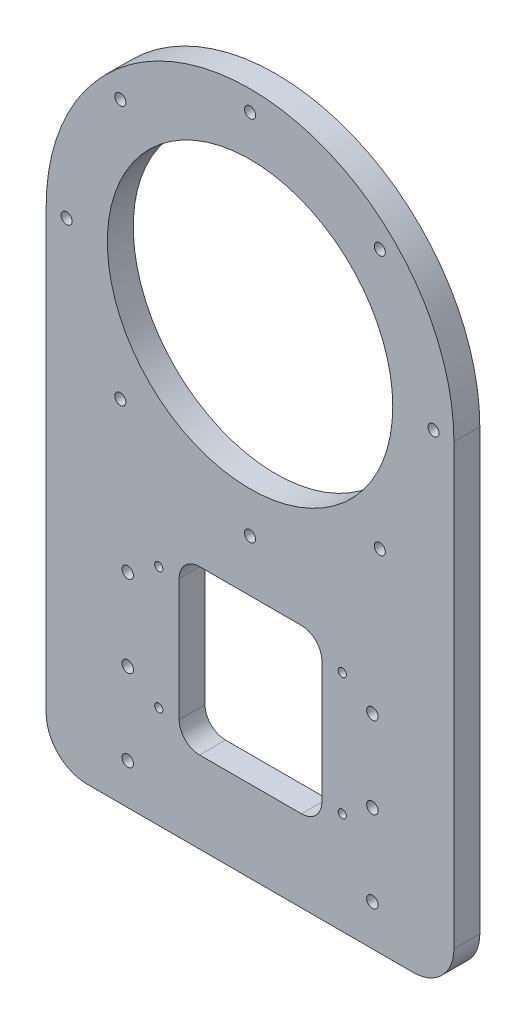
ISO-10303-21;
HEADER;
FILE_DESCRIPTION(('STEP AP214'),'2;1');
FILE_NAME('part.step','',(''),(''),'','','');
FILE_SCHEMA(('AUTOMOTIVE_DESIGN { 1 0 10303 214 1 1 1 1 }'));
ENDSEC;
DATA;
#1=APPLICATION_CONTEXT('core data for automotive mechanical design processes');
#2=APPLICATION_PROTOCOL_DEFINITION('international standard','automotive_design',2000,#1);
#3=PRODUCT_CONTEXT('',#1,'mechanical');
#4=PRODUCT('Part','Part','',(#3));
#5=PRODUCT_RELATED_PRODUCT_CATEGORY('part','',(#4));
#6=PRODUCT_DEFINITION_FORMATION('','',#4);
#7=PRODUCT_DEFINITION_CONTEXT('part definition',#1,'design');
#8=PRODUCT_DEFINITION('design','',#6,#7);
#9=PRODUCT_DEFINITION_SHAPE('','',#8);
#10=(LENGTH_UNIT() NAMED_UNIT(*) SI_UNIT(.MILLI.,.METRE.));
#11=(NAMED_UNIT(*) PLANE_ANGLE_UNIT() SI_UNIT($,.RADIAN.));
#12=(NAMED_UNIT(*) SI_UNIT($,.STERADIAN.) SOLID_ANGLE_UNIT());
#13=UNCERTAINTY_MEASURE_WITH_UNIT(LENGTH_MEASURE(1.E-05),#10,'distance_accuracy_value','');
#14=(GEOMETRIC_REPRESENTATION_CONTEXT(3) GLOBAL_UNCERTAINTY_ASSIGNED_CONTEXT((#13)) GLOBAL_UNIT_ASSIGNED_CONTEXT((#10,
#11,#12)) REPRESENTATION_CONTEXT('',''));
#15=CARTESIAN_POINT('',(0.,0.,0.));
#16=DIRECTION('',(0.,0.,1.));
#17=DIRECTION('',(1.,0.,0.));
#18=AXIS2_PLACEMENT_3D('',#15,#16,#17);
#19=CARTESIAN_POINT('',(0.,0.,6.35));
#20=DIRECTION('',(0.,0.,1.));
#21=DIRECTION('',(1.,0.,0.));
#22=AXIS2_PLACEMENT_3D('',#19,#20,#21);
#23=PLANE('',#22);
#24=CARTESIAN_POINT('',(22.6100045908899,-62.7000000000005,6.35));
#25=DIRECTION('',(0.,0.,-1.));
#26=DIRECTION('',(-1.,0.,0.));
#27=AXIS2_PLACEMENT_3D('',#24,#25,#26);
#28=CIRCLE('',#27,0.999999999999997);
#29=CARTESIAN_POINT('',(21.6100045908899,-62.7000000000005,6.35));
#30=VERTEX_POINT('',#29);
#31=EDGE_CURVE('E440',#30,#30,#28,.T.);
#32=ORIENTED_EDGE('',*,*,#31,.T.);
#33=EDGE_LOOP('',(#32));
#34=FACE_BOUND('',#33,.T.);
#35=CARTESIAN_POINT('',(22.6100045908899,-92.7000000000005,6.35));
#36=DIRECTION('',(0.,0.,-1.));
#37=DIRECTION('',(-1.,0.,0.));
#38=AXIS2_PLACEMENT_3D('',#35,#36,#37);
#39=CIRCLE('',#38,0.999999999999997);
#40=CARTESIAN_POINT('',(21.6100045908899,-92.7000000000005,6.35));
#41=VERTEX_POINT('',#40);
#42=EDGE_CURVE('E434',#41,#41,#39,.T.);
#43=ORIENTED_EDGE('',*,*,#42,.T.);
#44=EDGE_LOOP('',(#43));
#45=FACE_BOUND('',#44,.T.);
#46=CARTESIAN_POINT('',(-22.3899954091102,-92.7000000000005,6.35));
#47=DIRECTION('',(0.,0.,-1.));
#48=DIRECTION('',(-1.,0.,0.));
#49=AXIS2_PLACEMENT_3D('',#46,#47,#48);
#50=CIRCLE('',#49,0.999999999999997);
#51=CARTESIAN_POINT('',(-23.3899954091101,-92.7000000000005,6.35));
#52=VERTEX_POINT('',#51);
#53=EDGE_CURVE('E428',#52,#52,#50,.T.);
#54=ORIENTED_EDGE('',*,*,#53,.T.);
#55=EDGE_LOOP('',(#54));
#56=FACE_BOUND('',#55,.T.);
#57=CARTESIAN_POINT('',(-22.3899954091102,-62.7000000000005,6.35));
#58=DIRECTION('',(0.,0.,-1.));
#59=DIRECTION('',(-1.,0.,0.));
#60=AXIS2_PLACEMENT_3D('',#57,#58,#59);
#61=CIRCLE('',#60,0.999999999999997);
#62=CARTESIAN_POINT('',(-23.3899954091101,-62.7000000000005,6.35));
#63=VERTEX_POINT('',#62);
#64=EDGE_CURVE('E233',#63,#63,#61,.T.);
#65=ORIENTED_EDGE('',*,*,#64,.T.);
#66=EDGE_LOOP('',(#65));
#67=FACE_BOUND('',#66,.T.);
#68=DIRECTION('',(0.,-1.,0.));
#69=VECTOR('',#68,1.);
#70=CARTESIAN_POINT('',(-17.3899954091101,0.,6.35));
#71=LINE('',#70,#69);
#72=CARTESIAN_POINT('',(-17.3899954091101,-62.7000000000005,6.35));
#73=VERTEX_POINT('',#72);
#74=CARTESIAN_POINT('',(-17.3899954091101,-92.7000000000005,6.35));
#75=VERTEX_POINT('',#74);
#76=EDGE_CURVE('E242',#73,#75,#71,.T.);
#77=ORIENTED_EDGE('',*,*,#76,.F.);
#78=CARTESIAN_POINT('',(-12.3899954091101,-62.7000000000005,6.35));
#79=DIRECTION('',(0.,0.,1.));
#80=DIRECTION('',(1.,0.,0.));
#81=AXIS2_PLACEMENT_3D('',#78,#79,#80);
#82=CIRCLE('',#81,5.);
#83=CARTESIAN_POINT('',(-12.3899954091101,-57.7000000000005,6.35));
#84=VERTEX_POINT('',#83);
#85=EDGE_CURVE('E11',#73,#84,#82,.F.);
#86=ORIENTED_EDGE('',*,*,#85,.T.);
#87=DIRECTION('',(-1.,0.,0.));
#88=VECTOR('',#87,1.);
#89=CARTESIAN_POINT('',(0.,-57.7000000000005,6.35));
#90=LINE('',#89,#88);
#91=CARTESIAN_POINT('',(12.6100045908899,-57.7000000000005,6.35));
#92=VERTEX_POINT('',#91);
#93=EDGE_CURVE('E240',#92,#84,#90,.T.);
#94=ORIENTED_EDGE('',*,*,#93,.F.);
#95=CARTESIAN_POINT('',(12.6100045908899,-62.7000000000005,6.35));
#96=DIRECTION('',(0.,0.,1.));
#97=DIRECTION('',(1.,0.,0.));
#98=AXIS2_PLACEMENT_3D('',#95,#96,#97);
#99=CIRCLE('',#98,5.);
#100=CARTESIAN_POINT('',(17.6100045908899,-62.7000000000005,6.35));
#101=VERTEX_POINT('',#100);
#102=EDGE_CURVE('E222',#92,#101,#99,.F.);
#103=ORIENTED_EDGE('',*,*,#102,.T.);
#104=DIRECTION('',(0.,1.,0.));
#105=VECTOR('',#104,1.);
#106=CARTESIAN_POINT('',(17.6100045908899,0.,6.35));
#107=LINE('',#106,#105);
#108=CARTESIAN_POINT('',(17.6100045908899,-92.7000000000005,6.35));
#109=VERTEX_POINT('',#108);
#110=EDGE_CURVE('E246',#109,#101,#107,.T.);
#111=ORIENTED_EDGE('',*,*,#110,.F.);
#112=CARTESIAN_POINT('',(12.6100045908899,-92.7000000000005,6.35));
#113=DIRECTION('',(0.,0.,1.));
#114=DIRECTION('',(1.,0.,0.));
#115=AXIS2_PLACEMENT_3D('',#112,#113,#114);
#116=CIRCLE('',#115,5.);
#117=CARTESIAN_POINT('',(12.6100045908899,-97.7000000000005,6.35));
#118=VERTEX_POINT('',#117);
#119=EDGE_CURVE('E219',#109,#118,#116,.F.);
#120=ORIENTED_EDGE('',*,*,#119,.T.);
#121=DIRECTION('',(1.,0.,0.));
#122=VECTOR('',#121,1.);
#123=CARTESIAN_POINT('',(0.,-97.7000000000005,6.35));
#124=LINE('',#123,#122);
#125=CARTESIAN_POINT('',(-12.3899954091101,-97.7000000000005,6.35));
#126=VERTEX_POINT('',#125);
#127=EDGE_CURVE('E250',#126,#118,#124,.T.);
#128=ORIENTED_EDGE('',*,*,#127,.F.);
#129=CARTESIAN_POINT('',(-12.3899954091101,-92.7000000000005,6.35));
#130=DIRECTION('',(0.,0.,1.));
#131=DIRECTION('',(1.,0.,0.));
#132=AXIS2_PLACEMENT_3D('',#129,#130,#131);
#133=CIRCLE('',#132,5.);
#134=EDGE_CURVE('E215',#126,#75,#133,.F.);
#135=ORIENTED_EDGE('',*,*,#134,.T.);
#136=EDGE_LOOP('',(#77,#86,#94,#103,#111,#120,#128,#135));
#137=FACE_BOUND('',#136,.T.);
#138=CARTESIAN_POINT('',(-30.,-107.7,6.35));
#139=DIRECTION('',(0.,0.,1.));
#140=DIRECTION('',(1.,0.,0.));
#141=AXIS2_PLACEMENT_3D('',#138,#139,#140);
#142=CIRCLE('',#141,1.4);
#143=CARTESIAN_POINT('',(-28.6,-107.7,6.35));
#144=VERTEX_POINT('',#143);
#145=EDGE_CURVE('E260',#144,#144,#142,.T.);
#146=ORIENTED_EDGE('',*,*,#145,.F.);
#147=EDGE_LOOP('',(#146));
#148=FACE_BOUND('',#147,.T.);
#149=CARTESIAN_POINT('',(30.,-107.7,6.35));
#150=DIRECTION('',(0.,0.,1.));
#151=DIRECTION('',(1.,0.,0.));
#152=AXIS2_PLACEMENT_3D('',#149,#150,#151);
#153=CIRCLE('',#152,1.4);
#154=CARTESIAN_POINT('',(31.4,-107.7,6.35));
#155=VERTEX_POINT('',#154);
#156=EDGE_CURVE('E266',#155,#155,#153,.T.);
#157=ORIENTED_EDGE('',*,*,#156,.F.);
#158=EDGE_LOOP('',(#157));
#159=FACE_BOUND('',#158,.T.);
#160=CARTESIAN_POINT('',(29.9999999999999,-87.7000000000005,6.35));
#161=DIRECTION('',(0.,0.,1.));
#162=DIRECTION('',(1.,0.,0.));
#163=AXIS2_PLACEMENT_3D('',#160,#161,#162);
#164=CIRCLE('',#163,1.4);
#165=CARTESIAN_POINT('',(31.3999999999999,-87.7000000000005,6.35));
#166=VERTEX_POINT('',#165);
#167=EDGE_CURVE('E272',#166,#166,#164,.T.);
#168=ORIENTED_EDGE('',*,*,#167,.F.);
#169=EDGE_LOOP('',(#168));
#170=FACE_BOUND('',#169,.T.);
#171=CARTESIAN_POINT('',(-30.0000000000001,-87.7000000000005,6.35));
#172=DIRECTION('',(0.,0.,1.));
#173=DIRECTION('',(1.,0.,0.));
#174=AXIS2_PLACEMENT_3D('',#171,#172,#173);
#175=CIRCLE('',#174,1.4);
#176=CARTESIAN_POINT('',(-28.6000000000001,-87.7000000000005,6.35));
#177=VERTEX_POINT('',#176);
#178=EDGE_CURVE('E278',#177,#177,#175,.T.);
#179=ORIENTED_EDGE('',*,*,#178,.F.);
#180=EDGE_LOOP('',(#179));
#181=FACE_BOUND('',#180,.T.);
#182=CARTESIAN_POINT('',(29.9999999999999,-67.7000000000005,6.35));
#183=DIRECTION('',(0.,0.,1.));
#184=DIRECTION('',(1.,0.,0.));
#185=AXIS2_PLACEMENT_3D('',#182,#183,#184);
#186=CIRCLE('',#185,1.4);
#187=CARTESIAN_POINT('',(31.3999999999999,-67.7000000000005,6.35));
#188=VERTEX_POINT('',#187);
#189=EDGE_CURVE('E284',#188,#188,#186,.T.);
#190=ORIENTED_EDGE('',*,*,#189,.F.);
#191=EDGE_LOOP('',(#190));
#192=FACE_BOUND('',#191,.T.);
#193=CARTESIAN_POINT('',(-30.0000000000001,-67.7000000000005,6.35));
#194=DIRECTION('',(0.,0.,1.));
#195=DIRECTION('',(1.,0.,0.));
#196=AXIS2_PLACEMENT_3D('',#193,#194,#195);
#197=CIRCLE('',#196,1.4);
#198=CARTESIAN_POINT('',(-28.6000000000001,-67.7000000000005,6.35));
#199=VERTEX_POINT('',#198);
#200=EDGE_CURVE('E290',#199,#199,#197,.T.);
#201=ORIENTED_EDGE('',*,*,#200,.F.);
#202=EDGE_LOOP('',(#201));
#203=FACE_BOUND('',#202,.T.);
#204=CARTESIAN_POINT('',(-45.,3.14233320495882E-13,6.35));
#205=DIRECTION('',(0.,0.,1.));
#206=DIRECTION('',(1.,0.,0.));
#207=AXIS2_PLACEMENT_3D('',#204,#205,#206);
#208=CIRCLE('',#207,1.35255);
#209=CARTESIAN_POINT('',(-43.64745,3.14233320495882E-13,6.35));
#210=VERTEX_POINT('',#209);
#211=EDGE_CURVE('E296',#210,#210,#208,.T.);
#212=ORIENTED_EDGE('',*,*,#211,.F.);
#213=EDGE_LOOP('',(#212));
#214=FACE_BOUND('',#213,.T.);
#215=CARTESIAN_POINT('',(-31.8198051533948,-31.8198051533945,6.35));
#216=DIRECTION('',(0.,0.,1.));
#217=DIRECTION('',(1.,0.,0.));
#218=AXIS2_PLACEMENT_3D('',#215,#216,#217);
#219=CIRCLE('',#218,1.35255);
#220=CARTESIAN_POINT('',(-30.4672551533948,-31.8198051533945,6.35));
#221=VERTEX_POINT('',#220);
#222=EDGE_CURVE('E302',#221,#221,#219,.T.);
#223=ORIENTED_EDGE('',*,*,#222,.F.);
#224=EDGE_LOOP('',(#223));
#225=FACE_BOUND('',#224,.T.);
#226=CARTESIAN_POINT('',(-1.57116660247941E-13,-45.,6.35));
#227=DIRECTION('',(0.,0.,1.));
#228=DIRECTION('',(1.,0.,0.));
#229=AXIS2_PLACEMENT_3D('',#226,#227,#228);
#230=CIRCLE('',#229,1.35255);
#231=CARTESIAN_POINT('',(1.35254999999984,-45.,6.35));
#232=VERTEX_POINT('',#231);
#233=EDGE_CURVE('E308',#232,#232,#230,.T.);
#234=ORIENTED_EDGE('',*,*,#233,.F.);
#235=EDGE_LOOP('',(#234));
#236=FACE_BOUND('',#235,.T.);
#237=CARTESIAN_POINT('',(31.8198051533946,-31.8198051533947,6.35));
#238=DIRECTION('',(0.,0.,1.));
#239=DIRECTION('',(1.,0.,0.));
#240=AXIS2_PLACEMENT_3D('',#237,#238,#239);
#241=CIRCLE('',#240,1.35255);
#242=CARTESIAN_POINT('',(33.1723551533946,-31.8198051533947,6.35));
#243=VERTEX_POINT('',#242);
#244=EDGE_CURVE('E314',#243,#243,#241,.T.);
#245=ORIENTED_EDGE('',*,*,#244,.F.);
#246=EDGE_LOOP('',(#245));
#247=FACE_BOUND('',#246,.T.);
#248=CARTESIAN_POINT('',(45.,0.,6.35));
#249=DIRECTION('',(0.,0.,1.));
#250=DIRECTION('',(1.,0.,0.));
#251=AXIS2_PLACEMENT_3D('',#248,#249,#250);
#252=CIRCLE('',#251,1.35255);
#253=CARTESIAN_POINT('',(46.35255,0.,6.35));
#254=VERTEX_POINT('',#253);
#255=EDGE_CURVE('E320',#254,#254,#252,.T.);
#256=ORIENTED_EDGE('',*,*,#255,.F.);
#257=EDGE_LOOP('',(#256));
#258=FACE_BOUND('',#257,.T.);
#259=CARTESIAN_POINT('',(31.819805153395,31.8198051533942,6.35));
#260=DIRECTION('',(0.,0.,1.));
#261=DIRECTION('',(1.,0.,0.));
#262=AXIS2_PLACEMENT_3D('',#259,#260,#261);
#263=CIRCLE('',#262,1.35255);
#264=CARTESIAN_POINT('',(33.172355153395,31.8198051533942,6.35));
#265=VERTEX_POINT('',#264);
#266=EDGE_CURVE('E326',#265,#265,#263,.T.);
#267=ORIENTED_EDGE('',*,*,#266,.F.);
#268=EDGE_LOOP('',(#267));
#269=FACE_BOUND('',#268,.T.);
#270=CARTESIAN_POINT('',(4.71349980743823E-13,45.,6.35));
#271=DIRECTION('',(0.,0.,1.));
#272=DIRECTION('',(1.,0.,0.));
#273=AXIS2_PLACEMENT_3D('',#270,#271,#272);
#274=CIRCLE('',#273,1.35255);
#275=CARTESIAN_POINT('',(1.35255000000047,45.,6.35));
#276=VERTEX_POINT('',#275);
#277=EDGE_CURVE('E332',#276,#276,#274,.T.);
#278=ORIENTED_EDGE('',*,*,#277,.F.);
#279=EDGE_LOOP('',(#278));
#280=FACE_BOUND('',#279,.T.);
#281=CARTESIAN_POINT('',(-31.8198051533944,31.8198051533949,6.35));
#282=DIRECTION('',(0.,0.,1.));
#283=DIRECTION('',(1.,0.,0.));
#284=AXIS2_PLACEMENT_3D('',#281,#282,#283);
#285=CIRCLE('',#284,1.35255);
#286=CARTESIAN_POINT('',(-30.4672551533944,31.8198051533949,6.35));
#287=VERTEX_POINT('',#286);
#288=EDGE_CURVE('E338',#287,#287,#285,.T.);
#289=ORIENTED_EDGE('',*,*,#288,.F.);
#290=EDGE_LOOP('',(#289));
#291=FACE_BOUND('',#290,.T.);
#292=DIRECTION('',(1.,0.,0.));
#293=VECTOR('',#292,1.);
#294=CARTESIAN_POINT('',(0.,-117.7,6.35));
#295=LINE('',#294,#293);
#296=CARTESIAN_POINT('',(-40.,-117.7,6.35));
#297=VERTEX_POINT('',#296);
#298=CARTESIAN_POINT('',(40.,-117.7,6.35));
#299=VERTEX_POINT('',#298);
#300=EDGE_CURVE('E344',#297,#299,#295,.T.);
#301=ORIENTED_EDGE('',*,*,#300,.T.);
#302=CARTESIAN_POINT('',(40.,-107.7,6.34999999999999));
#303=DIRECTION('',(0.,0.,1.));
#304=DIRECTION('',(1.,0.,0.));
#305=AXIS2_PLACEMENT_3D('',#302,#303,#304);
#306=CIRCLE('',#305,10.);
#307=CARTESIAN_POINT('',(50.,-107.7,6.35));
#308=VERTEX_POINT('',#307);
#309=EDGE_CURVE('E184',#299,#308,#306,.T.);
#310=ORIENTED_EDGE('',*,*,#309,.T.);
#311=DIRECTION('',(0.,-1.,0.));
#312=VECTOR('',#311,1.);
#313=CARTESIAN_POINT('',(50.,0.,6.35));
#314=LINE('',#313,#312);
#315=CARTESIAN_POINT('',(50.,0.,6.35));
#316=VERTEX_POINT('',#315);
#317=EDGE_CURVE('E167',#316,#308,#314,.T.);
#318=ORIENTED_EDGE('',*,*,#317,.F.);
#319=CARTESIAN_POINT('',(0.,0.,6.35));
#320=DIRECTION('',(0.,0.,1.));
#321=DIRECTION('',(1.,0.,0.));
#322=AXIS2_PLACEMENT_3D('',#319,#320,#321);
#323=CIRCLE('',#322,50.);
#324=CARTESIAN_POINT('',(-50.,0.,6.35));
#325=VERTEX_POINT('',#324);
#326=EDGE_CURVE('E158',#316,#325,#323,.T.);
#327=ORIENTED_EDGE('',*,*,#326,.T.);
#328=DIRECTION('',(0.,-1.,0.));
#329=VECTOR('',#328,1.);
#330=CARTESIAN_POINT('',(-50.,0.,6.35));
#331=LINE('',#330,#329);
#332=CARTESIAN_POINT('',(-50.,-107.7,6.35));
#333=VERTEX_POINT('',#332);
#334=EDGE_CURVE('E163',#325,#333,#331,.T.);
#335=ORIENTED_EDGE('',*,*,#334,.T.);
#336=CARTESIAN_POINT('',(-40.,-107.7,6.34999999999999));
#337=DIRECTION('',(0.,0.,1.));
#338=DIRECTION('',(1.,0.,0.));
#339=AXIS2_PLACEMENT_3D('',#336,#337,#338);
#340=CIRCLE('',#339,10.);
#341=EDGE_CURVE('E182',#333,#297,#340,.T.);
#342=ORIENTED_EDGE('',*,*,#341,.T.);
#343=EDGE_LOOP('',(#301,#310,#318,#327,#335,#342));
#344=FACE_BOUND('',#343,.T.);
#345=CARTESIAN_POINT('',(0.,0.,6.35));
#346=DIRECTION('',(0.,0.,1.));
#347=DIRECTION('',(1.,0.,0.));
#348=AXIS2_PLACEMENT_3D('',#345,#346,#347);
#349=CIRCLE('',#348,35.);
#350=CARTESIAN_POINT('',(35.,0.,6.35));
#351=VERTEX_POINT('',#350);
#352=EDGE_CURVE('E159',#351,#351,#349,.T.);
#353=ORIENTED_EDGE('',*,*,#352,.F.);
#354=EDGE_LOOP('',(#353));
#355=FACE_BOUND('',#354,.T.);
#356=ADVANCED_FACE('F36',(#34,#45,#56,#67,#137,#148,#159,#170,#181,#192,#203,#214,#225,#236,
#247,#258,#269,#280,#291,#344,#355),#23,.T.);
#357=CARTESIAN_POINT('',(0.,0.,0.));
#358=DIRECTION('',(0.,0.,1.));
#359=DIRECTION('',(1.,0.,0.));
#360=AXIS2_PLACEMENT_3D('',#357,#358,#359);
#361=PLANE('',#360);
#362=CARTESIAN_POINT('',(22.6100045908899,-62.7000000000005,0.));
#363=DIRECTION('',(0.,0.,-1.));
#364=DIRECTION('',(-1.,0.,0.));
#365=AXIS2_PLACEMENT_3D('',#362,#363,#364);
#366=CIRCLE('',#365,1.);
#367=CARTESIAN_POINT('',(21.6100045908899,-62.7000000000005,0.));
#368=VERTEX_POINT('',#367);
#369=EDGE_CURVE('E443',#368,#368,#366,.T.);
#370=ORIENTED_EDGE('',*,*,#369,.F.);
#371=EDGE_LOOP('',(#370));
#372=FACE_BOUND('',#371,.T.);
#373=CARTESIAN_POINT('',(22.6100045908899,-92.7000000000005,0.));
#374=DIRECTION('',(0.,0.,-1.));
#375=DIRECTION('',(-1.,0.,0.));
#376=AXIS2_PLACEMENT_3D('',#373,#374,#375);
#377=CIRCLE('',#376,1.);
#378=CARTESIAN_POINT('',(21.6100045908899,-92.7000000000005,0.));
#379=VERTEX_POINT('',#378);
#380=EDGE_CURVE('E437',#379,#379,#377,.T.);
#381=ORIENTED_EDGE('',*,*,#380,.F.);
#382=EDGE_LOOP('',(#381));
#383=FACE_BOUND('',#382,.T.);
#384=CARTESIAN_POINT('',(-22.3899954091102,-92.7000000000005,0.));
#385=DIRECTION('',(0.,0.,-1.));
#386=DIRECTION('',(-1.,0.,0.));
#387=AXIS2_PLACEMENT_3D('',#384,#385,#386);
#388=CIRCLE('',#387,1.);
#389=CARTESIAN_POINT('',(-23.3899954091102,-92.7000000000005,0.));
#390=VERTEX_POINT('',#389);
#391=EDGE_CURVE('E431',#390,#390,#388,.T.);
#392=ORIENTED_EDGE('',*,*,#391,.F.);
#393=EDGE_LOOP('',(#392));
#394=FACE_BOUND('',#393,.T.);
#395=CARTESIAN_POINT('',(-22.3899954091102,-62.7000000000005,0.));
#396=DIRECTION('',(0.,0.,-1.));
#397=DIRECTION('',(-1.,0.,0.));
#398=AXIS2_PLACEMENT_3D('',#395,#396,#397);
#399=CIRCLE('',#398,1.);
#400=CARTESIAN_POINT('',(-23.3899954091102,-62.7000000000005,0.));
#401=VERTEX_POINT('',#400);
#402=EDGE_CURVE('E425',#401,#401,#399,.T.);
#403=ORIENTED_EDGE('',*,*,#402,.F.);
#404=EDGE_LOOP('',(#403));
#405=FACE_BOUND('',#404,.T.);
#406=DIRECTION('',(1.,0.,0.));
#407=VECTOR('',#406,1.);
#408=CARTESIAN_POINT('',(17.6100045908899,-57.7000000000005,0.));
#409=LINE('',#408,#407);
#410=CARTESIAN_POINT('',(-12.3899954091101,-57.7000000000005,0.));
#411=VERTEX_POINT('',#410);
#412=CARTESIAN_POINT('',(12.6100045908899,-57.7000000000005,0.));
#413=VERTEX_POINT('',#412);
#414=EDGE_CURVE('E227',#411,#413,#409,.T.);
#415=ORIENTED_EDGE('',*,*,#414,.F.);
#416=CARTESIAN_POINT('',(-12.3899954091101,-62.7000000000005,0.));
#417=DIRECTION('',(0.,0.,1.));
#418=DIRECTION('',(1.,0.,0.));
#419=AXIS2_PLACEMENT_3D('',#416,#417,#418);
#420=CIRCLE('',#419,5.);
#421=CARTESIAN_POINT('',(-17.3899954091101,-62.7000000000005,0.));
#422=VERTEX_POINT('',#421);
#423=EDGE_CURVE('E44',#411,#422,#420,.T.);
#424=ORIENTED_EDGE('',*,*,#423,.T.);
#425=DIRECTION('',(0.,1.,0.));
#426=VECTOR('',#425,1.);
#427=CARTESIAN_POINT('',(-17.3899954091101,-97.7000000000005,0.));
#428=LINE('',#427,#426);
#429=CARTESIAN_POINT('',(-17.3899954091101,-92.7000000000005,0.));
#430=VERTEX_POINT('',#429);
#431=EDGE_CURVE('E226',#430,#422,#428,.T.);
#432=ORIENTED_EDGE('',*,*,#431,.F.);
#433=CARTESIAN_POINT('',(-12.3899954091101,-92.7000000000005,0.));
#434=DIRECTION('',(0.,0.,1.));
#435=DIRECTION('',(1.,0.,0.));
#436=AXIS2_PLACEMENT_3D('',#433,#434,#435);
#437=CIRCLE('',#436,5.);
#438=CARTESIAN_POINT('',(-12.3899954091101,-97.7000000000005,0.));
#439=VERTEX_POINT('',#438);
#440=EDGE_CURVE('E213',#430,#439,#437,.T.);
#441=ORIENTED_EDGE('',*,*,#440,.T.);
#442=DIRECTION('',(-1.,0.,0.));
#443=VECTOR('',#442,1.);
#444=CARTESIAN_POINT('',(17.6100045908899,-97.7000000000005,0.));
#445=LINE('',#444,#443);
#446=CARTESIAN_POINT('',(12.6100045908899,-97.7000000000005,0.));
#447=VERTEX_POINT('',#446);
#448=EDGE_CURVE('E247',#447,#439,#445,.T.);
#449=ORIENTED_EDGE('',*,*,#448,.F.);
#450=CARTESIAN_POINT('',(12.6100045908899,-92.7000000000005,0.));
#451=DIRECTION('',(0.,0.,1.));
#452=DIRECTION('',(1.,0.,0.));
#453=AXIS2_PLACEMENT_3D('',#450,#451,#452);
#454=CIRCLE('',#453,5.);
#455=CARTESIAN_POINT('',(17.6100045908899,-92.7000000000005,0.));
#456=VERTEX_POINT('',#455);
#457=EDGE_CURVE('E217',#447,#456,#454,.T.);
#458=ORIENTED_EDGE('',*,*,#457,.T.);
#459=DIRECTION('',(0.,-1.,0.));
#460=VECTOR('',#459,1.);
#461=CARTESIAN_POINT('',(17.6100045908899,-97.7000000000005,0.));
#462=LINE('',#461,#460);
#463=CARTESIAN_POINT('',(17.6100045908899,-62.7000000000005,0.));
#464=VERTEX_POINT('',#463);
#465=EDGE_CURVE('E253',#464,#456,#462,.T.);
#466=ORIENTED_EDGE('',*,*,#465,.F.);
#467=CARTESIAN_POINT('',(12.6100045908899,-62.7000000000005,0.));
#468=DIRECTION('',(0.,0.,1.));
#469=DIRECTION('',(1.,0.,0.));
#470=AXIS2_PLACEMENT_3D('',#467,#468,#469);
#471=CIRCLE('',#470,5.);
#472=EDGE_CURVE('E51',#464,#413,#471,.T.);
#473=ORIENTED_EDGE('',*,*,#472,.T.);
#474=EDGE_LOOP('',(#415,#424,#432,#441,#449,#458,#466,#473));
#475=FACE_BOUND('',#474,.T.);
#476=CARTESIAN_POINT('',(-30.,-107.7,0.));
#477=DIRECTION('',(0.,0.,1.));
#478=DIRECTION('',(1.,0.,0.));
#479=AXIS2_PLACEMENT_3D('',#476,#477,#478);
#480=CIRCLE('',#479,1.4);
#481=CARTESIAN_POINT('',(-28.6,-107.7,0.));
#482=VERTEX_POINT('',#481);
#483=EDGE_CURVE('E263',#482,#482,#480,.T.);
#484=ORIENTED_EDGE('',*,*,#483,.T.);
#485=EDGE_LOOP('',(#484));
#486=FACE_BOUND('',#485,.T.);
#487=CARTESIAN_POINT('',(30.,-107.7,0.));
#488=DIRECTION('',(0.,0.,1.));
#489=DIRECTION('',(1.,0.,0.));
#490=AXIS2_PLACEMENT_3D('',#487,#488,#489);
#491=CIRCLE('',#490,1.4);
#492=CARTESIAN_POINT('',(31.4,-107.7,0.));
#493=VERTEX_POINT('',#492);
#494=EDGE_CURVE('E269',#493,#493,#491,.T.);
#495=ORIENTED_EDGE('',*,*,#494,.T.);
#496=EDGE_LOOP('',(#495));
#497=FACE_BOUND('',#496,.T.);
#498=CARTESIAN_POINT('',(29.9999999999999,-87.7000000000005,0.));
#499=DIRECTION('',(0.,0.,1.));
#500=DIRECTION('',(1.,0.,0.));
#501=AXIS2_PLACEMENT_3D('',#498,#499,#500);
#502=CIRCLE('',#501,1.4);
#503=CARTESIAN_POINT('',(31.3999999999999,-87.7000000000005,0.));
#504=VERTEX_POINT('',#503);
#505=EDGE_CURVE('E275',#504,#504,#502,.T.);
#506=ORIENTED_EDGE('',*,*,#505,.T.);
#507=EDGE_LOOP('',(#506));
#508=FACE_BOUND('',#507,.T.);
#509=CARTESIAN_POINT('',(-30.0000000000001,-87.7000000000005,0.));
#510=DIRECTION('',(0.,0.,1.));
#511=DIRECTION('',(1.,0.,0.));
#512=AXIS2_PLACEMENT_3D('',#509,#510,#511);
#513=CIRCLE('',#512,1.4);
#514=CARTESIAN_POINT('',(-28.6000000000001,-87.7000000000005,0.));
#515=VERTEX_POINT('',#514);
#516=EDGE_CURVE('E281',#515,#515,#513,.T.);
#517=ORIENTED_EDGE('',*,*,#516,.T.);
#518=EDGE_LOOP('',(#517));
#519=FACE_BOUND('',#518,.T.);
#520=CARTESIAN_POINT('',(29.9999999999999,-67.7000000000005,0.));
#521=DIRECTION('',(0.,0.,1.));
#522=DIRECTION('',(1.,0.,0.));
#523=AXIS2_PLACEMENT_3D('',#520,#521,#522);
#524=CIRCLE('',#523,1.4);
#525=CARTESIAN_POINT('',(31.3999999999999,-67.7000000000005,0.));
#526=VERTEX_POINT('',#525);
#527=EDGE_CURVE('E287',#526,#526,#524,.T.);
#528=ORIENTED_EDGE('',*,*,#527,.T.);
#529=EDGE_LOOP('',(#528));
#530=FACE_BOUND('',#529,.T.);
#531=CARTESIAN_POINT('',(-30.0000000000001,-67.7000000000005,0.));
#532=DIRECTION('',(0.,0.,1.));
#533=DIRECTION('',(1.,0.,0.));
#534=AXIS2_PLACEMENT_3D('',#531,#532,#533);
#535=CIRCLE('',#534,1.4);
#536=CARTESIAN_POINT('',(-28.6000000000001,-67.7000000000005,0.));
#537=VERTEX_POINT('',#536);
#538=EDGE_CURVE('E293',#537,#537,#535,.T.);
#539=ORIENTED_EDGE('',*,*,#538,.T.);
#540=EDGE_LOOP('',(#539));
#541=FACE_BOUND('',#540,.T.);
#542=CARTESIAN_POINT('',(-45.,3.14233320495882E-13,0.));
#543=DIRECTION('',(0.,0.,1.));
#544=DIRECTION('',(1.,0.,0.));
#545=AXIS2_PLACEMENT_3D('',#542,#543,#544);
#546=CIRCLE('',#545,1.35255);
#547=CARTESIAN_POINT('',(-43.64745,3.14233320495882E-13,0.));
#548=VERTEX_POINT('',#547);
#549=EDGE_CURVE('E299',#548,#548,#546,.T.);
#550=ORIENTED_EDGE('',*,*,#549,.T.);
#551=EDGE_LOOP('',(#550));
#552=FACE_BOUND('',#551,.T.);
#553=CARTESIAN_POINT('',(-31.8198051533948,-31.8198051533945,0.));
#554=DIRECTION('',(0.,0.,1.));
#555=DIRECTION('',(1.,0.,0.));
#556=AXIS2_PLACEMENT_3D('',#553,#554,#555);
#557=CIRCLE('',#556,1.35255);
#558=CARTESIAN_POINT('',(-30.4672551533948,-31.8198051533945,0.));
#559=VERTEX_POINT('',#558);
#560=EDGE_CURVE('E305',#559,#559,#557,.T.);
#561=ORIENTED_EDGE('',*,*,#560,.T.);
#562=EDGE_LOOP('',(#561));
#563=FACE_BOUND('',#562,.T.);
#564=CARTESIAN_POINT('',(-1.57116660247941E-13,-45.,0.));
#565=DIRECTION('',(0.,0.,1.));
#566=DIRECTION('',(1.,0.,0.));
#567=AXIS2_PLACEMENT_3D('',#564,#565,#566);
#568=CIRCLE('',#567,1.35255);
#569=CARTESIAN_POINT('',(1.35254999999984,-45.,0.));
#570=VERTEX_POINT('',#569);
#571=EDGE_CURVE('E311',#570,#570,#568,.T.);
#572=ORIENTED_EDGE('',*,*,#571,.T.);
#573=EDGE_LOOP('',(#572));
#574=FACE_BOUND('',#573,.T.);
#575=CARTESIAN_POINT('',(31.8198051533946,-31.8198051533947,0.));
#576=DIRECTION('',(0.,0.,1.));
#577=DIRECTION('',(1.,0.,0.));
#578=AXIS2_PLACEMENT_3D('',#575,#576,#577);
#579=CIRCLE('',#578,1.35255);
#580=CARTESIAN_POINT('',(33.1723551533946,-31.8198051533947,0.));
#581=VERTEX_POINT('',#580);
#582=EDGE_CURVE('E317',#581,#581,#579,.T.);
#583=ORIENTED_EDGE('',*,*,#582,.T.);
#584=EDGE_LOOP('',(#583));
#585=FACE_BOUND('',#584,.T.);
#586=CARTESIAN_POINT('',(45.,0.,0.));
#587=DIRECTION('',(0.,0.,1.));
#588=DIRECTION('',(1.,0.,0.));
#589=AXIS2_PLACEMENT_3D('',#586,#587,#588);
#590=CIRCLE('',#589,1.35255);
#591=CARTESIAN_POINT('',(46.35255,0.,0.));
#592=VERTEX_POINT('',#591);
#593=EDGE_CURVE('E323',#592,#592,#590,.T.);
#594=ORIENTED_EDGE('',*,*,#593,.T.);
#595=EDGE_LOOP('',(#594));
#596=FACE_BOUND('',#595,.T.);
#597=CARTESIAN_POINT('',(31.819805153395,31.8198051533942,0.));
#598=DIRECTION('',(0.,0.,1.));
#599=DIRECTION('',(1.,0.,0.));
#600=AXIS2_PLACEMENT_3D('',#597,#598,#599);
#601=CIRCLE('',#600,1.35255);
#602=CARTESIAN_POINT('',(33.172355153395,31.8198051533942,0.));
#603=VERTEX_POINT('',#602);
#604=EDGE_CURVE('E329',#603,#603,#601,.T.);
#605=ORIENTED_EDGE('',*,*,#604,.T.);
#606=EDGE_LOOP('',(#605));
#607=FACE_BOUND('',#606,.T.);
#608=CARTESIAN_POINT('',(4.71349980743823E-13,45.,0.));
#609=DIRECTION('',(0.,0.,1.));
#610=DIRECTION('',(1.,0.,0.));
#611=AXIS2_PLACEMENT_3D('',#608,#609,#610);
#612=CIRCLE('',#611,1.35255);
#613=CARTESIAN_POINT('',(1.35255000000047,45.,0.));
#614=VERTEX_POINT('',#613);
#615=EDGE_CURVE('E335',#614,#614,#612,.T.);
#616=ORIENTED_EDGE('',*,*,#615,.T.);
#617=EDGE_LOOP('',(#616));
#618=FACE_BOUND('',#617,.T.);
#619=CARTESIAN_POINT('',(-31.8198051533944,31.8198051533949,0.));
#620=DIRECTION('',(0.,0.,1.));
#621=DIRECTION('',(1.,0.,0.));
#622=AXIS2_PLACEMENT_3D('',#619,#620,#621);
#623=CIRCLE('',#622,1.35255);
#624=CARTESIAN_POINT('',(-30.4672551533944,31.8198051533949,0.));
#625=VERTEX_POINT('',#624);
#626=EDGE_CURVE('E341',#625,#625,#623,.T.);
#627=ORIENTED_EDGE('',*,*,#626,.T.);
#628=EDGE_LOOP('',(#627));
#629=FACE_BOUND('',#628,.T.);
#630=DIRECTION('',(0.,1.,0.));
#631=VECTOR('',#630,1.);
#632=CARTESIAN_POINT('',(50.,0.,0.));
#633=LINE('',#632,#631);
#634=CARTESIAN_POINT('',(50.,-107.7,0.));
#635=VERTEX_POINT('',#634);
#636=CARTESIAN_POINT('',(50.,0.,0.));
#637=VERTEX_POINT('',#636);
#638=EDGE_CURVE('E137',#635,#637,#633,.T.);
#639=ORIENTED_EDGE('',*,*,#638,.F.);
#640=CARTESIAN_POINT('',(40.,-107.7,0.));
#641=DIRECTION('',(0.,0.,1.));
#642=DIRECTION('',(1.,0.,0.));
#643=AXIS2_PLACEMENT_3D('',#640,#641,#642);
#644=CIRCLE('',#643,10.);
#645=CARTESIAN_POINT('',(40.,-117.7,0.));
#646=VERTEX_POINT('',#645);
#647=EDGE_CURVE('E189',#635,#646,#644,.F.);
#648=ORIENTED_EDGE('',*,*,#647,.T.);
#649=DIRECTION('',(-1.,0.,0.));
#650=VECTOR('',#649,1.);
#651=CARTESIAN_POINT('',(0.,-117.7,0.));
#652=LINE('',#651,#650);
#653=CARTESIAN_POINT('',(-40.,-117.7,0.));
#654=VERTEX_POINT('',#653);
#655=EDGE_CURVE('E175',#646,#654,#652,.T.);
#656=ORIENTED_EDGE('',*,*,#655,.T.);
#657=CARTESIAN_POINT('',(-40.,-107.7,0.));
#658=DIRECTION('',(0.,0.,1.));
#659=DIRECTION('',(1.,0.,0.));
#660=AXIS2_PLACEMENT_3D('',#657,#658,#659);
#661=CIRCLE('',#660,10.);
#662=CARTESIAN_POINT('',(-50.,-107.7,0.));
#663=VERTEX_POINT('',#662);
#664=EDGE_CURVE('E187',#654,#663,#661,.F.);
#665=ORIENTED_EDGE('',*,*,#664,.T.);
#666=DIRECTION('',(0.,1.,0.));
#667=VECTOR('',#666,1.);
#668=CARTESIAN_POINT('',(-50.,0.,0.));
#669=LINE('',#668,#667);
#670=CARTESIAN_POINT('',(-50.,0.,0.));
#671=VERTEX_POINT('',#670);
#672=EDGE_CURVE('E148',#663,#671,#669,.T.);
#673=ORIENTED_EDGE('',*,*,#672,.T.);
#674=CARTESIAN_POINT('',(0.,0.,0.));
#675=DIRECTION('',(0.,0.,1.));
#676=DIRECTION('',(1.,0.,0.));
#677=AXIS2_PLACEMENT_3D('',#674,#675,#676);
#678=CIRCLE('',#677,50.);
#679=EDGE_CURVE('E152',#637,#671,#678,.T.);
#680=ORIENTED_EDGE('',*,*,#679,.F.);
#681=EDGE_LOOP('',(#639,#648,#656,#665,#673,#680));
#682=FACE_BOUND('',#681,.T.);
#683=CARTESIAN_POINT('',(0.,0.,0.));
#684=DIRECTION('',(0.,0.,1.));
#685=DIRECTION('',(1.,0.,0.));
#686=AXIS2_PLACEMENT_3D('',#683,#684,#685);
#687=CIRCLE('',#686,35.);
#688=CARTESIAN_POINT('',(35.,0.,0.));
#689=VERTEX_POINT('',#688);
#690=EDGE_CURVE('E172',#689,#689,#687,.T.);
#691=ORIENTED_EDGE('',*,*,#690,.T.);
#692=EDGE_LOOP('',(#691));
#693=FACE_BOUND('',#692,.T.);
#694=ADVANCED_FACE('F153',(#372,#383,#394,#405,#475,#486,#497,#508,#519,#530,#541,#552,#563,
#574,#585,#596,#607,#618,#629,#682,#693),#361,.F.);
#695=CARTESIAN_POINT('',(0.,0.,6.35));
#696=DIRECTION('',(0.,0.,-1.));
#697=DIRECTION('',(-1.,0.,0.));
#698=AXIS2_PLACEMENT_3D('',#695,#696,#697);
#699=CYLINDRICAL_SURFACE('',#698,50.);
#700=ORIENTED_EDGE('',*,*,#326,.F.);
#701=DIRECTION('',(0.,0.,1.));
#702=VECTOR('',#701,1.);
#703=CARTESIAN_POINT('',(50.,0.,-154.44510351578));
#704=LINE('',#703,#702);
#705=EDGE_CURVE('E142',#637,#316,#704,.T.);
#706=ORIENTED_EDGE('',*,*,#705,.F.);
#707=ORIENTED_EDGE('',*,*,#679,.T.);
#708=DIRECTION('',(0.,0.,1.));
#709=VECTOR('',#708,1.);
#710=CARTESIAN_POINT('',(-50.,0.,-154.44510351578));
#711=LINE('',#710,#709);
#712=EDGE_CURVE('E149',#671,#325,#711,.T.);
#713=ORIENTED_EDGE('',*,*,#712,.T.);
#714=EDGE_LOOP('',(#700,#706,#707,#713));
#715=FACE_BOUND('',#714,.T.);
#716=ADVANCED_FACE('F161',(#715),#699,.T.);
#717=CARTESIAN_POINT('',(0.,0.,6.35));
#718=DIRECTION('',(0.,0.,-1.));
#719=DIRECTION('',(-1.,0.,0.));
#720=AXIS2_PLACEMENT_3D('',#717,#718,#719);
#721=CYLINDRICAL_SURFACE('',#720,35.);
#722=ORIENTED_EDGE('',*,*,#352,.T.);
#723=EDGE_LOOP('',(#722));
#724=FACE_BOUND('',#723,.T.);
#725=ORIENTED_EDGE('',*,*,#690,.F.);
#726=EDGE_LOOP('',(#725));
#727=FACE_BOUND('',#726,.T.);
#728=ADVANCED_FACE('F372',(#724,#727),#721,.F.);
#729=CARTESIAN_POINT('',(50.,0.,-154.44510351578));
#730=DIRECTION('',(-1.,0.,0.));
#731=DIRECTION('',(0.,0.,1.));
#732=AXIS2_PLACEMENT_3D('',#729,#730,#731);
#733=PLANE('',#732);
#734=ORIENTED_EDGE('',*,*,#317,.T.);
#735=DIRECTION('',(0.,0.,1.));
#736=VECTOR('',#735,1.);
#737=CARTESIAN_POINT('',(50.,-107.7,0.));
#738=LINE('',#737,#736);
#739=EDGE_CURVE('E145',#308,#635,#738,.F.);
#740=ORIENTED_EDGE('',*,*,#739,.T.);
#741=ORIENTED_EDGE('',*,*,#638,.T.);
#742=ORIENTED_EDGE('',*,*,#705,.T.);
#743=EDGE_LOOP('',(#734,#740,#741,#742));
#744=FACE_BOUND('',#743,.T.);
#745=ADVANCED_FACE('F140',(#744),#733,.F.);
#746=CARTESIAN_POINT('',(-50.,0.,-154.44510351578));
#747=DIRECTION('',(-1.,0.,0.));
#748=DIRECTION('',(0.,-1.,0.));
#749=AXIS2_PLACEMENT_3D('',#746,#747,#748);
#750=PLANE('',#749);
#751=ORIENTED_EDGE('',*,*,#672,.F.);
#752=DIRECTION('',(0.,0.,1.));
#753=VECTOR('',#752,1.);
#754=CARTESIAN_POINT('',(-50.,-107.7,-154.44510351578));
#755=LINE('',#754,#753);
#756=EDGE_CURVE('E191',#663,#333,#755,.T.);
#757=ORIENTED_EDGE('',*,*,#756,.T.);
#758=ORIENTED_EDGE('',*,*,#334,.F.);
#759=ORIENTED_EDGE('',*,*,#712,.F.);
#760=EDGE_LOOP('',(#751,#757,#758,#759));
#761=FACE_BOUND('',#760,.T.);
#762=ADVANCED_FACE('F364',(#761),#750,.T.);
#763=CARTESIAN_POINT('',(0.,-117.7,-154.44510351578));
#764=DIRECTION('',(0.,-1.,0.));
#765=DIRECTION('',(0.,0.,-1.));
#766=AXIS2_PLACEMENT_3D('',#763,#764,#765);
#767=PLANE('',#766);
#768=ORIENTED_EDGE('',*,*,#655,.F.);
#769=DIRECTION('',(0.,0.,1.));
#770=VECTOR('',#769,1.);
#771=CARTESIAN_POINT('',(40.,-117.7,6.34999999999999));
#772=LINE('',#771,#770);
#773=EDGE_CURVE('E179',#646,#299,#772,.T.);
#774=ORIENTED_EDGE('',*,*,#773,.T.);
#775=ORIENTED_EDGE('',*,*,#300,.F.);
#776=DIRECTION('',(0.,0.,1.));
#777=VECTOR('',#776,1.);
#778=CARTESIAN_POINT('',(-40.,-117.7,-154.44510351578));
#779=LINE('',#778,#777);
#780=EDGE_CURVE('E176',#297,#654,#779,.F.);
#781=ORIENTED_EDGE('',*,*,#780,.T.);
#782=EDGE_LOOP('',(#768,#774,#775,#781));
#783=FACE_BOUND('',#782,.T.);
#784=ADVANCED_FACE('F357',(#783),#767,.T.);
#785=CARTESIAN_POINT('',(-31.8198051533944,31.8198051533949,6.35));
#786=DIRECTION('',(0.,0.,1.));
#787=DIRECTION('',(1.,0.,0.));
#788=AXIS2_PLACEMENT_3D('',#785,#786,#787);
#789=CYLINDRICAL_SURFACE('',#788,1.35255);
#790=ORIENTED_EDGE('',*,*,#626,.F.);
#791=EDGE_LOOP('',(#790));
#792=FACE_BOUND('',#791,.T.);
#793=ORIENTED_EDGE('',*,*,#288,.T.);
#794=EDGE_LOOP('',(#793));
#795=FACE_BOUND('',#794,.T.);
#796=ADVANCED_FACE('F522',(#792,#795),#789,.F.);
#797=CARTESIAN_POINT('',(4.71349980743823E-13,45.,6.35));
#798=DIRECTION('',(0.,0.,1.));
#799=DIRECTION('',(1.,0.,0.));
#800=AXIS2_PLACEMENT_3D('',#797,#798,#799);
#801=CYLINDRICAL_SURFACE('',#800,1.35255);
#802=ORIENTED_EDGE('',*,*,#615,.F.);
#803=EDGE_LOOP('',(#802));
#804=FACE_BOUND('',#803,.T.);
#805=ORIENTED_EDGE('',*,*,#277,.T.);
#806=EDGE_LOOP('',(#805));
#807=FACE_BOUND('',#806,.T.);
#808=ADVANCED_FACE('F518',(#804,#807),#801,.F.);
#809=CARTESIAN_POINT('',(31.819805153395,31.8198051533942,6.35));
#810=DIRECTION('',(0.,0.,1.));
#811=DIRECTION('',(1.,0.,0.));
#812=AXIS2_PLACEMENT_3D('',#809,#810,#811);
#813=CYLINDRICAL_SURFACE('',#812,1.35255);
#814=ORIENTED_EDGE('',*,*,#604,.F.);
#815=EDGE_LOOP('',(#814));
#816=FACE_BOUND('',#815,.T.);
#817=ORIENTED_EDGE('',*,*,#266,.T.);
#818=EDGE_LOOP('',(#817));
#819=FACE_BOUND('',#818,.T.);
#820=ADVANCED_FACE('F514',(#816,#819),#813,.F.);
#821=CARTESIAN_POINT('',(45.,0.,6.35));
#822=DIRECTION('',(0.,0.,1.));
#823=DIRECTION('',(1.,0.,0.));
#824=AXIS2_PLACEMENT_3D('',#821,#822,#823);
#825=CYLINDRICAL_SURFACE('',#824,1.35255);
#826=ORIENTED_EDGE('',*,*,#593,.F.);
#827=EDGE_LOOP('',(#826));
#828=FACE_BOUND('',#827,.T.);
#829=ORIENTED_EDGE('',*,*,#255,.T.);
#830=EDGE_LOOP('',(#829));
#831=FACE_BOUND('',#830,.T.);
#832=ADVANCED_FACE('F510',(#828,#831),#825,.F.);
#833=CARTESIAN_POINT('',(31.8198051533946,-31.8198051533947,6.35));
#834=DIRECTION('',(0.,0.,1.));
#835=DIRECTION('',(1.,0.,0.));
#836=AXIS2_PLACEMENT_3D('',#833,#834,#835);
#837=CYLINDRICAL_SURFACE('',#836,1.35255);
#838=ORIENTED_EDGE('',*,*,#582,.F.);
#839=EDGE_LOOP('',(#838));
#840=FACE_BOUND('',#839,.T.);
#841=ORIENTED_EDGE('',*,*,#244,.T.);
#842=EDGE_LOOP('',(#841));
#843=FACE_BOUND('',#842,.T.);
#844=ADVANCED_FACE('F506',(#840,#843),#837,.F.);
#845=CARTESIAN_POINT('',(-1.57116660247941E-13,-45.,6.35));
#846=DIRECTION('',(0.,0.,1.));
#847=DIRECTION('',(1.,0.,0.));
#848=AXIS2_PLACEMENT_3D('',#845,#846,#847);
#849=CYLINDRICAL_SURFACE('',#848,1.35255);
#850=ORIENTED_EDGE('',*,*,#571,.F.);
#851=EDGE_LOOP('',(#850));
#852=FACE_BOUND('',#851,.T.);
#853=ORIENTED_EDGE('',*,*,#233,.T.);
#854=EDGE_LOOP('',(#853));
#855=FACE_BOUND('',#854,.T.);
#856=ADVANCED_FACE('F502',(#852,#855),#849,.F.);
#857=CARTESIAN_POINT('',(-31.8198051533948,-31.8198051533945,6.35));
#858=DIRECTION('',(0.,0.,1.));
#859=DIRECTION('',(1.,0.,0.));
#860=AXIS2_PLACEMENT_3D('',#857,#858,#859);
#861=CYLINDRICAL_SURFACE('',#860,1.35255);
#862=ORIENTED_EDGE('',*,*,#560,.F.);
#863=EDGE_LOOP('',(#862));
#864=FACE_BOUND('',#863,.T.);
#865=ORIENTED_EDGE('',*,*,#222,.T.);
#866=EDGE_LOOP('',(#865));
#867=FACE_BOUND('',#866,.T.);
#868=ADVANCED_FACE('F498',(#864,#867),#861,.F.);
#869=CARTESIAN_POINT('',(-45.,3.14233320495882E-13,6.35));
#870=DIRECTION('',(0.,0.,1.));
#871=DIRECTION('',(1.,0.,0.));
#872=AXIS2_PLACEMENT_3D('',#869,#870,#871);
#873=CYLINDRICAL_SURFACE('',#872,1.35255);
#874=ORIENTED_EDGE('',*,*,#549,.F.);
#875=EDGE_LOOP('',(#874));
#876=FACE_BOUND('',#875,.T.);
#877=ORIENTED_EDGE('',*,*,#211,.T.);
#878=EDGE_LOOP('',(#877));
#879=FACE_BOUND('',#878,.T.);
#880=ADVANCED_FACE('F389',(#876,#879),#873,.F.);
#881=CARTESIAN_POINT('',(40.,-107.7,-154.44510351578));
#882=DIRECTION('',(0.,0.,-1.));
#883=DIRECTION('',(-1.,0.,0.));
#884=AXIS2_PLACEMENT_3D('',#881,#882,#883);
#885=CYLINDRICAL_SURFACE('',#884,10.);
#886=ORIENTED_EDGE('',*,*,#647,.F.);
#887=ORIENTED_EDGE('',*,*,#739,.F.);
#888=ORIENTED_EDGE('',*,*,#309,.F.);
#889=ORIENTED_EDGE('',*,*,#773,.F.);
#890=EDGE_LOOP('',(#886,#887,#888,#889));
#891=FACE_BOUND('',#890,.T.);
#892=ADVANCED_FACE('F352',(#891),#885,.T.);
#893=CARTESIAN_POINT('',(-40.,-107.7,-154.44510351578));
#894=DIRECTION('',(0.,0.,1.));
#895=DIRECTION('',(1.,0.,0.));
#896=AXIS2_PLACEMENT_3D('',#893,#894,#895);
#897=CYLINDRICAL_SURFACE('',#896,10.);
#898=ORIENTED_EDGE('',*,*,#664,.F.);
#899=ORIENTED_EDGE('',*,*,#780,.F.);
#900=ORIENTED_EDGE('',*,*,#341,.F.);
#901=ORIENTED_EDGE('',*,*,#756,.F.);
#902=EDGE_LOOP('',(#898,#899,#900,#901));
#903=FACE_BOUND('',#902,.T.);
#904=ADVANCED_FACE('F361',(#903),#897,.T.);
#905=CARTESIAN_POINT('',(-30.0000000000001,-67.7000000000005,6.35));
#906=DIRECTION('',(0.,0.,1.));
#907=DIRECTION('',(1.,0.,0.));
#908=AXIS2_PLACEMENT_3D('',#905,#906,#907);
#909=CYLINDRICAL_SURFACE('',#908,1.4);
#910=ORIENTED_EDGE('',*,*,#538,.F.);
#911=EDGE_LOOP('',(#910));
#912=FACE_BOUND('',#911,.T.);
#913=ORIENTED_EDGE('',*,*,#200,.T.);
#914=EDGE_LOOP('',(#913));
#915=FACE_BOUND('',#914,.T.);
#916=ADVANCED_FACE('F392',(#912,#915),#909,.F.);
#917=CARTESIAN_POINT('',(29.9999999999999,-67.7000000000005,6.35));
#918=DIRECTION('',(0.,0.,1.));
#919=DIRECTION('',(1.,0.,0.));
#920=AXIS2_PLACEMENT_3D('',#917,#918,#919);
#921=CYLINDRICAL_SURFACE('',#920,1.4);
#922=ORIENTED_EDGE('',*,*,#527,.F.);
#923=EDGE_LOOP('',(#922));
#924=FACE_BOUND('',#923,.T.);
#925=ORIENTED_EDGE('',*,*,#189,.T.);
#926=EDGE_LOOP('',(#925));
#927=FACE_BOUND('',#926,.T.);
#928=ADVANCED_FACE('F488',(#924,#927),#921,.F.);
#929=CARTESIAN_POINT('',(-30.0000000000001,-87.7000000000005,6.35));
#930=DIRECTION('',(0.,0.,1.));
#931=DIRECTION('',(1.,0.,0.));
#932=AXIS2_PLACEMENT_3D('',#929,#930,#931);
#933=CYLINDRICAL_SURFACE('',#932,1.4);
#934=ORIENTED_EDGE('',*,*,#516,.F.);
#935=EDGE_LOOP('',(#934));
#936=FACE_BOUND('',#935,.T.);
#937=ORIENTED_EDGE('',*,*,#178,.T.);
#938=EDGE_LOOP('',(#937));
#939=FACE_BOUND('',#938,.T.);
#940=ADVANCED_FACE('F484',(#936,#939),#933,.F.);
#941=CARTESIAN_POINT('',(29.9999999999999,-87.7000000000005,6.35));
#942=DIRECTION('',(0.,0.,1.));
#943=DIRECTION('',(1.,0.,0.));
#944=AXIS2_PLACEMENT_3D('',#941,#942,#943);
#945=CYLINDRICAL_SURFACE('',#944,1.4);
#946=ORIENTED_EDGE('',*,*,#505,.F.);
#947=EDGE_LOOP('',(#946));
#948=FACE_BOUND('',#947,.T.);
#949=ORIENTED_EDGE('',*,*,#167,.T.);
#950=EDGE_LOOP('',(#949));
#951=FACE_BOUND('',#950,.T.);
#952=ADVANCED_FACE('F480',(#948,#951),#945,.F.);
#953=CARTESIAN_POINT('',(30.,-107.7,6.35));
#954=DIRECTION('',(0.,0.,1.));
#955=DIRECTION('',(1.,0.,0.));
#956=AXIS2_PLACEMENT_3D('',#953,#954,#955);
#957=CYLINDRICAL_SURFACE('',#956,1.4);
#958=ORIENTED_EDGE('',*,*,#494,.F.);
#959=EDGE_LOOP('',(#958));
#960=FACE_BOUND('',#959,.T.);
#961=ORIENTED_EDGE('',*,*,#156,.T.);
#962=EDGE_LOOP('',(#961));
#963=FACE_BOUND('',#962,.T.);
#964=ADVANCED_FACE('F476',(#960,#963),#957,.F.);
#965=CARTESIAN_POINT('',(-30.,-107.7,6.35));
#966=DIRECTION('',(0.,0.,1.));
#967=DIRECTION('',(1.,0.,0.));
#968=AXIS2_PLACEMENT_3D('',#965,#966,#967);
#969=CYLINDRICAL_SURFACE('',#968,1.4);
#970=ORIENTED_EDGE('',*,*,#483,.F.);
#971=EDGE_LOOP('',(#970));
#972=FACE_BOUND('',#971,.T.);
#973=ORIENTED_EDGE('',*,*,#145,.T.);
#974=EDGE_LOOP('',(#973));
#975=FACE_BOUND('',#974,.T.);
#976=ADVANCED_FACE('F473',(#972,#975),#969,.F.);
#977=CARTESIAN_POINT('',(-17.3899954091101,-97.7000000000005,10.));
#978=DIRECTION('',(-1.,0.,0.));
#979=DIRECTION('',(0.,0.,1.));
#980=AXIS2_PLACEMENT_3D('',#977,#978,#979);
#981=PLANE('',#980);
#982=ORIENTED_EDGE('',*,*,#76,.T.);
#983=DIRECTION('',(0.,0.,-1.));
#984=VECTOR('',#983,1.);
#985=CARTESIAN_POINT('',(-17.3899954091101,-92.7000000000005,0.));
#986=LINE('',#985,#984);
#987=EDGE_CURVE('E196',#75,#430,#986,.T.);
#988=ORIENTED_EDGE('',*,*,#987,.T.);
#989=ORIENTED_EDGE('',*,*,#431,.T.);
#990=DIRECTION('',(0.,0.,-1.));
#991=VECTOR('',#990,1.);
#992=CARTESIAN_POINT('',(-17.3899954091101,-62.7000000000005,6.35));
#993=LINE('',#992,#991);
#994=EDGE_CURVE('E194',#422,#73,#993,.F.);
#995=ORIENTED_EDGE('',*,*,#994,.T.);
#996=EDGE_LOOP('',(#982,#988,#989,#995));
#997=FACE_BOUND('',#996,.T.);
#998=ADVANCED_FACE('F230',(#997),#981,.F.);
#999=CARTESIAN_POINT('',(17.6100045908899,-97.7000000000005,10.));
#1000=DIRECTION('',(0.,-1.,0.));
#1001=DIRECTION('',(0.,0.,-1.));
#1002=AXIS2_PLACEMENT_3D('',#999,#1000,#1001);
#1003=PLANE('',#1002);
#1004=ORIENTED_EDGE('',*,*,#448,.T.);
#1005=DIRECTION('',(0.,0.,-1.));
#1006=VECTOR('',#1005,1.);
#1007=CARTESIAN_POINT('',(-12.3899954091101,-97.7000000000005,6.35));
#1008=LINE('',#1007,#1006);
#1009=EDGE_CURVE('E202',#439,#126,#1008,.F.);
#1010=ORIENTED_EDGE('',*,*,#1009,.T.);
#1011=ORIENTED_EDGE('',*,*,#127,.T.);
#1012=DIRECTION('',(0.,0.,-1.));
#1013=VECTOR('',#1012,1.);
#1014=CARTESIAN_POINT('',(12.6100045908899,-97.7000000000005,0.));
#1015=LINE('',#1014,#1013);
#1016=EDGE_CURVE('E199',#118,#447,#1015,.T.);
#1017=ORIENTED_EDGE('',*,*,#1016,.T.);
#1018=EDGE_LOOP('',(#1004,#1010,#1011,#1017));
#1019=FACE_BOUND('',#1018,.T.);
#1020=ADVANCED_FACE('F418',(#1019),#1003,.F.);
#1021=CARTESIAN_POINT('',(17.6100045908899,-97.7000000000005,10.));
#1022=DIRECTION('',(1.,0.,0.));
#1023=DIRECTION('',(0.,0.,-1.));
#1024=AXIS2_PLACEMENT_3D('',#1021,#1022,#1023);
#1025=PLANE('',#1024);
#1026=ORIENTED_EDGE('',*,*,#465,.T.);
#1027=DIRECTION('',(0.,0.,-1.));
#1028=VECTOR('',#1027,1.);
#1029=CARTESIAN_POINT('',(17.6100045908899,-92.7000000000005,6.35));
#1030=LINE('',#1029,#1028);
#1031=EDGE_CURVE('E207',#456,#109,#1030,.F.);
#1032=ORIENTED_EDGE('',*,*,#1031,.T.);
#1033=ORIENTED_EDGE('',*,*,#110,.T.);
#1034=DIRECTION('',(0.,0.,-1.));
#1035=VECTOR('',#1034,1.);
#1036=CARTESIAN_POINT('',(17.6100045908899,-62.7000000000005,0.));
#1037=LINE('',#1036,#1035);
#1038=EDGE_CURVE('E204',#101,#464,#1037,.T.);
#1039=ORIENTED_EDGE('',*,*,#1038,.T.);
#1040=EDGE_LOOP('',(#1026,#1032,#1033,#1039));
#1041=FACE_BOUND('',#1040,.T.);
#1042=ADVANCED_FACE('F412',(#1041),#1025,.F.);
#1043=CARTESIAN_POINT('',(17.6100045908899,-57.7000000000005,10.));
#1044=DIRECTION('',(0.,1.,0.));
#1045=DIRECTION('',(0.,0.,1.));
#1046=AXIS2_PLACEMENT_3D('',#1043,#1044,#1045);
#1047=PLANE('',#1046);
#1048=ORIENTED_EDGE('',*,*,#414,.T.);
#1049=DIRECTION('',(0.,0.,-1.));
#1050=VECTOR('',#1049,1.);
#1051=CARTESIAN_POINT('',(12.6100045908899,-57.7000000000005,6.35));
#1052=LINE('',#1051,#1050);
#1053=EDGE_CURVE('E211',#413,#92,#1052,.F.);
#1054=ORIENTED_EDGE('',*,*,#1053,.T.);
#1055=ORIENTED_EDGE('',*,*,#93,.T.);
#1056=DIRECTION('',(0.,0.,-1.));
#1057=VECTOR('',#1056,1.);
#1058=CARTESIAN_POINT('',(-12.3899954091101,-57.7000000000005,0.));
#1059=LINE('',#1058,#1057);
#1060=EDGE_CURVE('E209',#84,#411,#1059,.T.);
#1061=ORIENTED_EDGE('',*,*,#1060,.T.);
#1062=EDGE_LOOP('',(#1048,#1054,#1055,#1061));
#1063=FACE_BOUND('',#1062,.T.);
#1064=ADVANCED_FACE('F244',(#1063),#1047,.F.);
#1065=CARTESIAN_POINT('',(-12.3899954091101,-92.7000000000005,10.));
#1066=DIRECTION('',(0.,0.,1.));
#1067=DIRECTION('',(1.,0.,0.));
#1068=AXIS2_PLACEMENT_3D('',#1065,#1066,#1067);
#1069=CYLINDRICAL_SURFACE('',#1068,5.);
#1070=ORIENTED_EDGE('',*,*,#134,.F.);
#1071=ORIENTED_EDGE('',*,*,#1009,.F.);
#1072=ORIENTED_EDGE('',*,*,#440,.F.);
#1073=ORIENTED_EDGE('',*,*,#987,.F.);
#1074=EDGE_LOOP('',(#1070,#1071,#1072,#1073));
#1075=FACE_BOUND('',#1074,.T.);
#1076=ADVANCED_FACE('F393',(#1075),#1069,.F.);
#1077=CARTESIAN_POINT('',(12.6100045908899,-92.7000000000005,10.));
#1078=DIRECTION('',(0.,0.,1.));
#1079=DIRECTION('',(1.,0.,0.));
#1080=AXIS2_PLACEMENT_3D('',#1077,#1078,#1079);
#1081=CYLINDRICAL_SURFACE('',#1080,5.);
#1082=ORIENTED_EDGE('',*,*,#119,.F.);
#1083=ORIENTED_EDGE('',*,*,#1031,.F.);
#1084=ORIENTED_EDGE('',*,*,#457,.F.);
#1085=ORIENTED_EDGE('',*,*,#1016,.F.);
#1086=EDGE_LOOP('',(#1082,#1083,#1084,#1085));
#1087=FACE_BOUND('',#1086,.T.);
#1088=ADVANCED_FACE('F396',(#1087),#1081,.F.);
#1089=CARTESIAN_POINT('',(12.6100045908899,-62.7000000000005,10.));
#1090=DIRECTION('',(0.,0.,1.));
#1091=DIRECTION('',(1.,0.,0.));
#1092=AXIS2_PLACEMENT_3D('',#1089,#1090,#1091);
#1093=CYLINDRICAL_SURFACE('',#1092,5.);
#1094=ORIENTED_EDGE('',*,*,#102,.F.);
#1095=ORIENTED_EDGE('',*,*,#1053,.F.);
#1096=ORIENTED_EDGE('',*,*,#472,.F.);
#1097=ORIENTED_EDGE('',*,*,#1038,.F.);
#1098=EDGE_LOOP('',(#1094,#1095,#1096,#1097));
#1099=FACE_BOUND('',#1098,.T.);
#1100=ADVANCED_FACE('F399',(#1099),#1093,.F.);
#1101=CARTESIAN_POINT('',(-12.3899954091101,-62.7000000000005,10.));
#1102=DIRECTION('',(0.,0.,1.));
#1103=DIRECTION('',(1.,0.,0.));
#1104=AXIS2_PLACEMENT_3D('',#1101,#1102,#1103);
#1105=CYLINDRICAL_SURFACE('',#1104,5.);
#1106=ORIENTED_EDGE('',*,*,#85,.F.);
#1107=ORIENTED_EDGE('',*,*,#994,.F.);
#1108=ORIENTED_EDGE('',*,*,#423,.F.);
#1109=ORIENTED_EDGE('',*,*,#1060,.F.);
#1110=EDGE_LOOP('',(#1106,#1107,#1108,#1109));
#1111=FACE_BOUND('',#1110,.T.);
#1112=ADVANCED_FACE('F38',(#1111),#1105,.F.);
#1113=CARTESIAN_POINT('',(-22.3899954091102,-62.7000000000005,0.));
#1114=DIRECTION('',(0.,0.,-1.));
#1115=DIRECTION('',(-1.,0.,0.));
#1116=AXIS2_PLACEMENT_3D('',#1113,#1114,#1115);
#1117=CYLINDRICAL_SURFACE('',#1116,0.999999999999999);
#1118=ORIENTED_EDGE('',*,*,#64,.F.);
#1119=EDGE_LOOP('',(#1118));
#1120=FACE_BOUND('',#1119,.T.);
#1121=ORIENTED_EDGE('',*,*,#402,.T.);
#1122=EDGE_LOOP('',(#1121));
#1123=FACE_BOUND('',#1122,.T.);
#1124=ADVANCED_FACE('F406',(#1120,#1123),#1117,.F.);
#1125=CARTESIAN_POINT('',(-22.3899954091102,-92.7000000000005,0.));
#1126=DIRECTION('',(0.,0.,-1.));
#1127=DIRECTION('',(-1.,0.,0.));
#1128=AXIS2_PLACEMENT_3D('',#1125,#1126,#1127);
#1129=CYLINDRICAL_SURFACE('',#1128,0.999999999999999);
#1130=ORIENTED_EDGE('',*,*,#53,.F.);
#1131=EDGE_LOOP('',(#1130));
#1132=FACE_BOUND('',#1131,.T.);
#1133=ORIENTED_EDGE('',*,*,#391,.T.);
#1134=EDGE_LOOP('',(#1133));
#1135=FACE_BOUND('',#1134,.T.);
#1136=ADVANCED_FACE('F454',(#1132,#1135),#1129,.F.);
#1137=CARTESIAN_POINT('',(22.6100045908899,-92.7000000000005,0.));
#1138=DIRECTION('',(0.,0.,-1.));
#1139=DIRECTION('',(-1.,0.,0.));
#1140=AXIS2_PLACEMENT_3D('',#1137,#1138,#1139);
#1141=CYLINDRICAL_SURFACE('',#1140,0.999999999999999);
#1142=ORIENTED_EDGE('',*,*,#42,.F.);
#1143=EDGE_LOOP('',(#1142));
#1144=FACE_BOUND('',#1143,.T.);
#1145=ORIENTED_EDGE('',*,*,#380,.T.);
#1146=EDGE_LOOP('',(#1145));
#1147=FACE_BOUND('',#1146,.T.);
#1148=ADVANCED_FACE('F448',(#1144,#1147),#1141,.F.);
#1149=CARTESIAN_POINT('',(22.6100045908899,-62.7000000000005,0.));
#1150=DIRECTION('',(0.,0.,-1.));
#1151=DIRECTION('',(-1.,0.,0.));
#1152=AXIS2_PLACEMENT_3D('',#1149,#1150,#1151);
#1153=CYLINDRICAL_SURFACE('',#1152,0.999999999999999);
#1154=ORIENTED_EDGE('',*,*,#31,.F.);
#1155=EDGE_LOOP('',(#1154));
#1156=FACE_BOUND('',#1155,.T.);
#1157=ORIENTED_EDGE('',*,*,#369,.T.);
#1158=EDGE_LOOP('',(#1157));
#1159=FACE_BOUND('',#1158,.T.);
#1160=ADVANCED_FACE('F446',(#1156,#1159),#1153,.F.);
#1161=CLOSED_SHELL('',(#356,#694,#716,#728,#745,#762,#784,#796,#808,#820,#832,#844,#856,#868,
#880,#892,#904,#916,#928,#940,#952,#964,#976,#998,#1020,#1042,#1064,#1076,#1088,#1100,#1112,
#1124,#1136,#1148,#1160));
#1162=MANIFOLD_SOLID_BREP('B2',#1161);
#1163=ADVANCED_BREP_SHAPE_REPRESENTATION('',(#18,#1162),#14);
#1164=SHAPE_DEFINITION_REPRESENTATION(#9,#1163);
ENDSEC;
END-ISO-10303-21;
